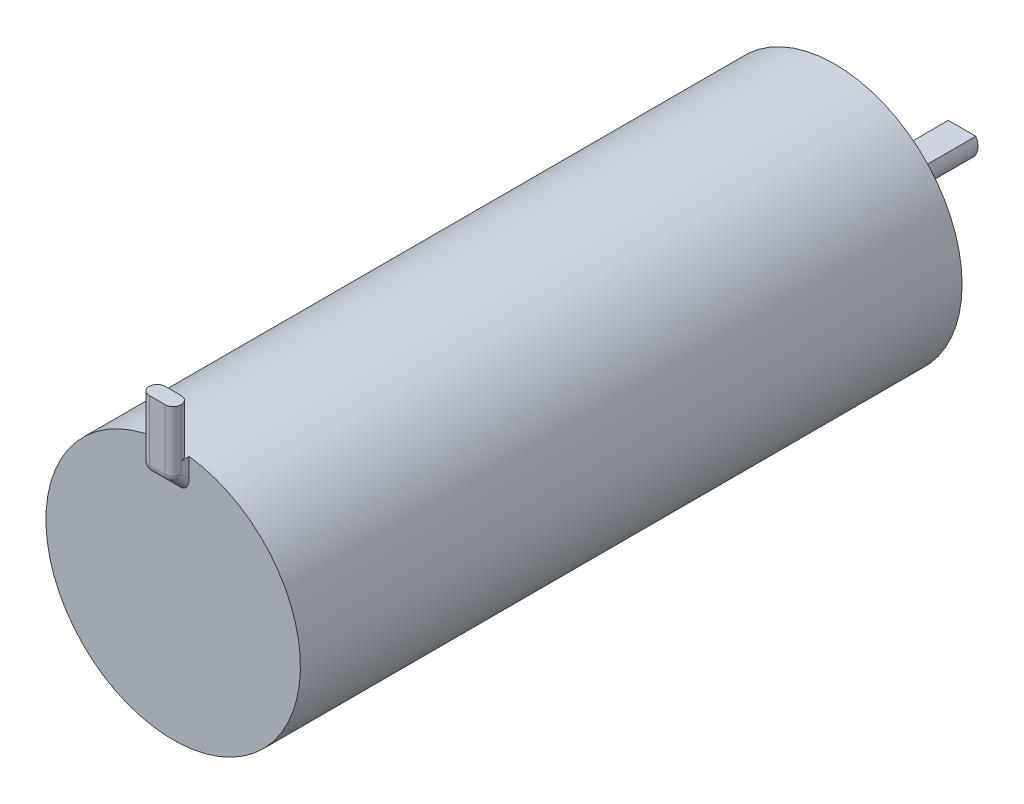
ISO-10303-21;
HEADER;
FILE_DESCRIPTION(('STEP AP214'),'2;1');
FILE_NAME('part.step','',(''),(''),'','','');
FILE_SCHEMA(('AUTOMOTIVE_DESIGN { 1 0 10303 214 1 1 1 1 }'));
ENDSEC;
DATA;
#1=APPLICATION_CONTEXT('core data for automotive mechanical design processes');
#2=APPLICATION_PROTOCOL_DEFINITION('international standard','automotive_design',2000,#1);
#3=PRODUCT_CONTEXT('',#1,'mechanical');
#4=PRODUCT('Part','Part','',(#3));
#5=PRODUCT_RELATED_PRODUCT_CATEGORY('part','',(#4));
#6=PRODUCT_DEFINITION_FORMATION('','',#4);
#7=PRODUCT_DEFINITION_CONTEXT('part definition',#1,'design');
#8=PRODUCT_DEFINITION('design','',#6,#7);
#9=PRODUCT_DEFINITION_SHAPE('','',#8);
#10=(LENGTH_UNIT() NAMED_UNIT(*) SI_UNIT(.MILLI.,.METRE.));
#11=(NAMED_UNIT(*) PLANE_ANGLE_UNIT() SI_UNIT($,.RADIAN.));
#12=(NAMED_UNIT(*) SI_UNIT($,.STERADIAN.) SOLID_ANGLE_UNIT());
#13=UNCERTAINTY_MEASURE_WITH_UNIT(LENGTH_MEASURE(1.E-05),#10,'distance_accuracy_value','');
#14=(GEOMETRIC_REPRESENTATION_CONTEXT(3) GLOBAL_UNCERTAINTY_ASSIGNED_CONTEXT((#13)) GLOBAL_UNIT_ASSIGNED_CONTEXT((#10,
#11,#12)) REPRESENTATION_CONTEXT('',''));
#15=CARTESIAN_POINT('',(0.,0.,0.));
#16=DIRECTION('',(0.,0.,1.));
#17=DIRECTION('',(1.,0.,0.));
#18=AXIS2_PLACEMENT_3D('',#15,#16,#17);
#19=CARTESIAN_POINT('',(0.,0.,0.));
#20=DIRECTION('',(0.,0.,1.));
#21=DIRECTION('',(1.,0.,0.));
#22=AXIS2_PLACEMENT_3D('',#19,#20,#21);
#23=PLANE('',#22);
#24=CARTESIAN_POINT('',(0.,0.,0.));
#25=DIRECTION('',(0.,0.,1.));
#26=DIRECTION('',(1.,0.,0.));
#27=AXIS2_PLACEMENT_3D('',#24,#25,#26);
#28=CIRCLE('',#27,8.);
#29=CARTESIAN_POINT('',(8.,0.,0.));
#30=VERTEX_POINT('',#29);
#31=EDGE_CURVE('E155',#30,#30,#28,.T.);
#32=ORIENTED_EDGE('',*,*,#31,.F.);
#33=EDGE_LOOP('',(#32));
#34=FACE_BOUND('',#33,.T.);
#35=CARTESIAN_POINT('',(0.,0.,0.));
#36=DIRECTION('',(0.,0.,1.));
#37=DIRECTION('',(1.,0.,0.));
#38=AXIS2_PLACEMENT_3D('',#35,#36,#37);
#39=CIRCLE('',#38,1.);
#40=CARTESIAN_POINT('',(1.,0.,0.));
#41=VERTEX_POINT('',#40);
#42=EDGE_CURVE('E137',#41,#41,#39,.F.);
#43=ORIENTED_EDGE('',*,*,#42,.F.);
#44=EDGE_LOOP('',(#43));
#45=FACE_BOUND('',#44,.T.);
#46=ADVANCED_FACE('F36',(#34,#45),#23,.F.);
#47=CARTESIAN_POINT('',(0.,0.,41.6));
#48=DIRECTION('',(0.,0.,-1.));
#49=DIRECTION('',(-1.,0.,0.));
#50=AXIS2_PLACEMENT_3D('',#47,#48,#49);
#51=CYLINDRICAL_SURFACE('',#50,8.);
#52=CARTESIAN_POINT('',(0.,0.,41.6));
#53=DIRECTION('',(0.,0.,1.));
#54=DIRECTION('',(1.,0.,0.));
#55=AXIS2_PLACEMENT_3D('',#52,#53,#54);
#56=CIRCLE('',#55,8.);
#57=CARTESIAN_POINT('',(0.499999999999999,7.98435971133566,41.6));
#58=VERTEX_POINT('',#57);
#59=CARTESIAN_POINT('',(-0.500000000000001,7.98435971133565,41.6));
#60=VERTEX_POINT('',#59);
#61=EDGE_CURVE('E161',#58,#60,#56,.T.);
#62=ORIENTED_EDGE('',*,*,#61,.F.);
#63=CARTESIAN_POINT('',(0.499999999999999,7.98435971133565,41.6));
#64=CARTESIAN_POINT('',(0.528211966881947,7.98259877056829,41.5999765813087));
#65=CARTESIAN_POINT('',(0.556404932265178,7.98067755120621,41.6023862602534));
#66=CARTESIAN_POINT('',(0.611949749492698,7.97660753691758,41.6118872498728));
#67=CARTESIAN_POINT('',(0.63930231043446,7.97445894104762,41.618974493584));
#68=CARTESIAN_POINT('',(0.692425208747163,7.97002292009895,41.6376502605687));
#69=CARTESIAN_POINT('',(0.718194928128985,7.96773544148065,41.6492405291839));
#70=CARTESIAN_POINT('',(0.767415560756234,7.96314530880473,41.676584171914));
#71=CARTESIAN_POINT('',(0.790866765661462,7.96084265669485,41.6923370214751));
#72=CARTESIAN_POINT('',(0.834832752569999,7.95635248198422,41.7275988043841));
#73=CARTESIAN_POINT('',(0.85534232695351,7.95416516779201,41.7471142590313));
#74=CARTESIAN_POINT('',(0.89279517918921,7.95004859020596,41.7893420183228));
#75=CARTESIAN_POINT('',(0.909737820722047,7.94811937287739,41.8120548921635));
#76=CARTESIAN_POINT('',(0.939526239124845,7.94465327490368,41.8599767760672));
#77=CARTESIAN_POINT('',(0.952381335669353,7.94311550337665,41.8851799335932));
#78=CARTESIAN_POINT('',(0.973663616764573,7.9405349226189,41.9374068345447));
#79=CARTESIAN_POINT('',(0.982093785202894,7.93949177988823,41.9644293372114));
#80=CARTESIAN_POINT('',(0.99211273854697,7.93824463092319,42.0096912906091));
#81=CARTESIAN_POINT('',(0.995068443825916,7.93787411954731,42.0276353473731));
#82=CARTESIAN_POINT('',(0.999011872019128,7.93737843656666,42.0637169413209));
#83=CARTESIAN_POINT('',(1.00000226912277,7.93725293158615,42.0818541817863));
#84=CARTESIAN_POINT('',(0.999999999999999,7.93725393319377,42.1));
#85=B_SPLINE_CURVE_WITH_KNOTS('',3,(#63,#64,#65,#66,#67,#68,#69,#70,#71,#72,#73,#74,#75,#76,#77,
#78,#79,#80,#81,#82,#83,#84),.UNSPECIFIED.,.F.,.F.,(4,2,2,2,2,2,2,2,2,2,4),(0.,
0.084684795232754,0.169296057104691,0.253940146489832,0.338573574404131,0.423355028395603,
0.508151594096252,0.592753412270701,0.677298106875425,0.731765628796676,0.786158985952355),.UNSPECIFIED.);
#86=CARTESIAN_POINT('',(0.999999999999999,7.93725393319377,42.1));
#87=VERTEX_POINT('',#86);
#88=EDGE_CURVE('E238',#58,#87,#85,.T.);
#89=ORIENTED_EDGE('',*,*,#88,.T.);
#90=DIRECTION('',(0.,0.,-1.));
#91=VECTOR('',#90,1.);
#92=CARTESIAN_POINT('',(0.999999999999999,7.93725393319377,41.6));
#93=LINE('',#92,#91);
#94=CARTESIAN_POINT('',(0.999999999999999,7.93725393319377,41.6));
#95=VERTEX_POINT('',#94);
#96=EDGE_CURVE('E60',#95,#87,#93,.F.);
#97=ORIENTED_EDGE('',*,*,#96,.F.);
#98=CARTESIAN_POINT('',(-1.,7.93725393319377,41.6));
#99=VERTEX_POINT('',#98);
#100=EDGE_CURVE('E172',#99,#95,#56,.T.);
#101=ORIENTED_EDGE('',*,*,#100,.F.);
#102=DIRECTION('',(0.,0.,-1.));
#103=VECTOR('',#102,1.);
#104=CARTESIAN_POINT('',(-1.,7.93725393319377,42.1));
#105=LINE('',#104,#103);
#106=CARTESIAN_POINT('',(-1.,7.93725393319377,42.1));
#107=VERTEX_POINT('',#106);
#108=EDGE_CURVE('E207',#107,#99,#105,.T.);
#109=ORIENTED_EDGE('',*,*,#108,.F.);
#110=CARTESIAN_POINT('',(-1.,7.93725393319377,42.1));
#111=CARTESIAN_POINT('',(-1.00002451729943,7.93724662536466,42.0720075643183));
#112=CARTESIAN_POINT('',(-0.997650787091199,7.93754984225721,42.0440241790816));
#113=CARTESIAN_POINT('',(-0.98829013972062,7.93872297592914,41.9888815242111));
#114=CARTESIAN_POINT('',(-0.981308150554138,7.93959228732318,41.9617214066045));
#115=CARTESIAN_POINT('',(-0.962910162137948,7.94184389296303,41.908958415712));
#116=CARTESIAN_POINT('',(-0.951492516323902,7.94322637769592,41.8833561247953));
#117=CARTESIAN_POINT('',(-0.924564287598282,7.94640580445675,41.8344359569982));
#118=CARTESIAN_POINT('',(-0.909054052642224,7.94820271124854,41.8111178861425));
#119=CARTESIAN_POINT('',(-0.874304834044239,7.95210014989678,41.7673124311631));
#120=CARTESIAN_POINT('',(-0.855050034319086,7.9542019596663,41.7468377085396));
#121=CARTESIAN_POINT('',(-0.813393883809545,7.95856948002514,41.7093997431199));
#122=CARTESIAN_POINT('',(-0.790991851298305,7.96083522607322,41.6924372630905));
#123=CARTESIAN_POINT('',(-0.74352285129241,7.96540929805311,41.6624035407285));
#124=CARTESIAN_POINT('',(-0.718440057456876,7.96771780187519,41.649357359664));
#125=CARTESIAN_POINT('',(-0.666434962346622,7.97223581109619,41.6276739408522));
#126=CARTESIAN_POINT('',(-0.639513736527306,7.97444537314295,41.6190341500638));
#127=CARTESIAN_POINT('',(-0.593699357532828,7.97796095832678,41.6084958937252));
#128=CARTESIAN_POINT('',(-0.575095875627013,7.97932411674346,41.6053129007842));
#129=CARTESIAN_POINT('',(-0.537665719098085,7.98193402991067,41.601065027193));
#130=CARTESIAN_POINT('',(-0.51883937163709,7.98318093599397,41.5999973551501));
#131=CARTESIAN_POINT('',(-0.499999999999999,7.98435971133566,41.6));
#132=B_SPLINE_CURVE_WITH_KNOTS('',3,(#110,#111,#112,#113,#114,#115,#116,#117,#118,#119,#120,
#121,#122,#123,#124,#125,#126,#127,#128,#129,#130,#131),.UNSPECIFIED.,.F.,.F.,(4,2,2,2,2,2,2,2,
2,2,4),(0.,0.0838618848451519,0.167634234166573,0.25143771046158,0.335234064006103,
0.419392355957126,0.503568905751166,0.588273167919629,0.672928296936279,0.729584662547124,
0.786166214078912),.UNSPECIFIED.);
#133=EDGE_CURVE('E232',#107,#60,#132,.T.);
#134=ORIENTED_EDGE('',*,*,#133,.T.);
#135=EDGE_LOOP('',(#62,#89,#97,#101,#109,#134));
#136=FACE_BOUND('',#135,.T.);
#137=ORIENTED_EDGE('',*,*,#31,.T.);
#138=EDGE_LOOP('',(#137));
#139=FACE_BOUND('',#138,.T.);
#140=ADVANCED_FACE('F243',(#136,#139),#51,.T.);
#141=CARTESIAN_POINT('',(0.,0.,41.6));
#142=DIRECTION('',(0.,0.,1.));
#143=DIRECTION('',(1.,0.,0.));
#144=AXIS2_PLACEMENT_3D('',#141,#142,#143);
#145=PLANE('',#144);
#146=DIRECTION('',(0.,-1.,0.));
#147=VECTOR('',#146,1.);
#148=CARTESIAN_POINT('',(-1.,11.,41.6));
#149=LINE('',#148,#147);
#150=CARTESIAN_POINT('',(-1.,6.70710678118655,41.6));
#151=VERTEX_POINT('',#150);
#152=EDGE_CURVE('E157',#99,#151,#149,.T.);
#153=ORIENTED_EDGE('',*,*,#152,.F.);
#154=ORIENTED_EDGE('',*,*,#100,.T.);
#155=DIRECTION('',(0.,1.,0.));
#156=VECTOR('',#155,1.);
#157=CARTESIAN_POINT('',(0.999999999999999,11.,41.6));
#158=LINE('',#157,#156);
#159=CARTESIAN_POINT('',(0.999999999999999,6.70710678118655,41.6));
#160=VERTEX_POINT('',#159);
#161=EDGE_CURVE('E165',#160,#95,#158,.T.);
#162=ORIENTED_EDGE('',*,*,#161,.F.);
#163=CARTESIAN_POINT('',(0.499999999999999,6.70710678118655,41.6));
#164=DIRECTION('',(0.,0.,1.));
#165=DIRECTION('',(0.,1.,0.));
#166=AXIS2_PLACEMENT_3D('',#163,#164,#165);
#167=ELLIPSE('',#166,0.707106781186545,0.5);
#168=CARTESIAN_POINT('',(0.5,6.,41.6));
#169=VERTEX_POINT('',#168);
#170=EDGE_CURVE('E204',#160,#169,#167,.F.);
#171=ORIENTED_EDGE('',*,*,#170,.T.);
#172=DIRECTION('',(1.,0.,0.));
#173=VECTOR('',#172,1.);
#174=CARTESIAN_POINT('',(-1.,6.,41.6));
#175=LINE('',#174,#173);
#176=CARTESIAN_POINT('',(-0.500000000000001,6.,41.6));
#177=VERTEX_POINT('',#176);
#178=EDGE_CURVE('E162',#177,#169,#175,.T.);
#179=ORIENTED_EDGE('',*,*,#178,.F.);
#180=CARTESIAN_POINT('',(-0.500000000000001,6.70710678118655,41.6));
#181=DIRECTION('',(0.,0.,1.));
#182=DIRECTION('',(0.,-1.,0.));
#183=AXIS2_PLACEMENT_3D('',#180,#181,#182);
#184=ELLIPSE('',#183,0.707106781186545,0.5);
#185=EDGE_CURVE('E206',#177,#151,#184,.F.);
#186=ORIENTED_EDGE('',*,*,#185,.T.);
#187=EDGE_LOOP('',(#153,#154,#162,#171,#179,#186));
#188=FACE_BOUND('',#187,.T.);
#189=ADVANCED_FACE('F294',(#188),#145,.T.);
#190=CARTESIAN_POINT('',(0.,0.,41.6));
#191=DIRECTION('',(0.,0.,1.));
#192=DIRECTION('',(1.,0.,0.));
#193=AXIS2_PLACEMENT_3D('',#190,#191,#192);
#194=PLANE('',#193);
#195=ORIENTED_EDGE('',*,*,#61,.T.);
#196=DIRECTION('',(0.,-1.,0.));
#197=VECTOR('',#196,1.);
#198=CARTESIAN_POINT('',(-0.499999999999999,0.,41.6));
#199=LINE('',#198,#197);
#200=CARTESIAN_POINT('',(-0.500000000000002,11.,41.6));
#201=VERTEX_POINT('',#200);
#202=EDGE_CURVE('E225',#60,#201,#199,.F.);
#203=ORIENTED_EDGE('',*,*,#202,.T.);
#204=DIRECTION('',(-1.,0.,0.));
#205=VECTOR('',#204,1.);
#206=CARTESIAN_POINT('',(-1.,11.,41.6));
#207=LINE('',#206,#205);
#208=CARTESIAN_POINT('',(0.499999999999999,11.,41.6));
#209=VERTEX_POINT('',#208);
#210=EDGE_CURVE('E156',#209,#201,#207,.T.);
#211=ORIENTED_EDGE('',*,*,#210,.F.);
#212=DIRECTION('',(0.,1.,0.));
#213=VECTOR('',#212,1.);
#214=CARTESIAN_POINT('',(0.500000000000001,0.,41.6));
#215=LINE('',#214,#213);
#216=EDGE_CURVE('E223',#209,#58,#215,.F.);
#217=ORIENTED_EDGE('',*,*,#216,.T.);
#218=EDGE_LOOP('',(#195,#203,#211,#217));
#219=FACE_BOUND('',#218,.T.);
#220=ADVANCED_FACE('F300',(#219),#194,.F.);
#221=CARTESIAN_POINT('',(-1.,11.,42.6));
#222=DIRECTION('',(1.,0.,0.));
#223=DIRECTION('',(0.,1.,0.));
#224=AXIS2_PLACEMENT_3D('',#221,#222,#223);
#225=PLANE('',#224);
#226=DIRECTION('',(0.,-1.,0.));
#227=VECTOR('',#226,1.);
#228=CARTESIAN_POINT('',(-1.,11.,42.1));
#229=LINE('',#228,#227);
#230=CARTESIAN_POINT('',(-1.,7.20710678118655,42.1));
#231=VERTEX_POINT('',#230);
#232=EDGE_CURVE('E199',#231,#107,#229,.F.);
#233=ORIENTED_EDGE('',*,*,#232,.T.);
#234=ORIENTED_EDGE('',*,*,#108,.T.);
#235=ORIENTED_EDGE('',*,*,#152,.T.);
#236=DIRECTION('',(0.,0.707106781186545,0.70710678118655));
#237=VECTOR('',#236,1.);
#238=CARTESIAN_POINT('',(-1.,7.35355339059327,42.2464466094067));
#239=LINE('',#238,#237);
#240=EDGE_CURVE('E202',#151,#231,#239,.T.);
#241=ORIENTED_EDGE('',*,*,#240,.T.);
#242=EDGE_LOOP('',(#233,#234,#235,#241));
#243=FACE_BOUND('',#242,.T.);
#244=ADVANCED_FACE('F302',(#243),#225,.F.);
#245=CARTESIAN_POINT('',(0.999999999999999,11.,42.6));
#246=DIRECTION('',(-1.,0.,0.));
#247=DIRECTION('',(0.,-1.,0.));
#248=AXIS2_PLACEMENT_3D('',#245,#246,#247);
#249=PLANE('',#248);
#250=ORIENTED_EDGE('',*,*,#161,.T.);
#251=ORIENTED_EDGE('',*,*,#96,.T.);
#252=DIRECTION('',(0.,1.,0.));
#253=VECTOR('',#252,1.);
#254=CARTESIAN_POINT('',(0.999999999999999,7.,42.1));
#255=LINE('',#254,#253);
#256=CARTESIAN_POINT('',(0.999999999999999,7.20710678118654,42.1));
#257=VERTEX_POINT('',#256);
#258=EDGE_CURVE('E187',#87,#257,#255,.F.);
#259=ORIENTED_EDGE('',*,*,#258,.T.);
#260=DIRECTION('',(0.,-0.707106781186545,-0.70710678118655));
#261=VECTOR('',#260,1.);
#262=CARTESIAN_POINT('',(1.,6.35355339059328,41.2464466094067));
#263=LINE('',#262,#261);
#264=EDGE_CURVE('E191',#257,#160,#263,.T.);
#265=ORIENTED_EDGE('',*,*,#264,.T.);
#266=EDGE_LOOP('',(#250,#251,#259,#265));
#267=FACE_BOUND('',#266,.T.);
#268=ADVANCED_FACE('F305',(#267),#249,.F.);
#269=CARTESIAN_POINT('',(-1.,11.,42.6));
#270=DIRECTION('',(0.,-1.,0.));
#271=DIRECTION('',(1.,0.,0.));
#272=AXIS2_PLACEMENT_3D('',#269,#270,#271);
#273=PLANE('',#272);
#274=ORIENTED_EDGE('',*,*,#210,.T.);
#275=CARTESIAN_POINT('',(-0.500000000000002,11.,42.1));
#276=DIRECTION('',(0.,-1.,0.));
#277=DIRECTION('',(1.,0.,0.));
#278=AXIS2_PLACEMENT_3D('',#275,#276,#277);
#279=CIRCLE('',#278,0.5);
#280=CARTESIAN_POINT('',(-1.,11.,42.1));
#281=VERTEX_POINT('',#280);
#282=EDGE_CURVE('E229',#201,#281,#279,.F.);
#283=ORIENTED_EDGE('',*,*,#282,.T.);
#284=CARTESIAN_POINT('',(-0.500000000000002,11.,42.1));
#285=DIRECTION('',(0.,-1.,0.));
#286=DIRECTION('',(1.,0.,0.));
#287=AXIS2_PLACEMENT_3D('',#284,#285,#286);
#288=CIRCLE('',#287,0.5);
#289=CARTESIAN_POINT('',(-0.500000000000002,11.,42.6));
#290=VERTEX_POINT('',#289);
#291=EDGE_CURVE('E193',#281,#290,#288,.F.);
#292=ORIENTED_EDGE('',*,*,#291,.T.);
#293=DIRECTION('',(-1.,0.,0.));
#294=VECTOR('',#293,1.);
#295=CARTESIAN_POINT('',(-1.,11.,42.6));
#296=LINE('',#295,#294);
#297=CARTESIAN_POINT('',(0.499999999999999,11.,42.6));
#298=VERTEX_POINT('',#297);
#299=EDGE_CURVE('E152',#298,#290,#296,.T.);
#300=ORIENTED_EDGE('',*,*,#299,.F.);
#301=CARTESIAN_POINT('',(0.499999999999999,11.,42.1));
#302=DIRECTION('',(0.,-1.,0.));
#303=DIRECTION('',(1.,0.,0.));
#304=AXIS2_PLACEMENT_3D('',#301,#302,#303);
#305=CIRCLE('',#304,0.5);
#306=CARTESIAN_POINT('',(0.999999999999999,11.,42.1));
#307=VERTEX_POINT('',#306);
#308=EDGE_CURVE('E195',#298,#307,#305,.F.);
#309=ORIENTED_EDGE('',*,*,#308,.T.);
#310=CARTESIAN_POINT('',(0.499999999999999,11.,42.1));
#311=DIRECTION('',(0.,-1.,0.));
#312=DIRECTION('',(1.,0.,0.));
#313=AXIS2_PLACEMENT_3D('',#310,#311,#312);
#314=CIRCLE('',#313,0.5);
#315=EDGE_CURVE('E227',#307,#209,#314,.F.);
#316=ORIENTED_EDGE('',*,*,#315,.T.);
#317=EDGE_LOOP('',(#274,#283,#292,#300,#309,#316));
#318=FACE_BOUND('',#317,.T.);
#319=ADVANCED_FACE('F286',(#318),#273,.F.);
#320=CARTESIAN_POINT('',(0.,0.,42.6));
#321=DIRECTION('',(0.,0.,1.));
#322=DIRECTION('',(1.,0.,0.));
#323=AXIS2_PLACEMENT_3D('',#320,#321,#322);
#324=PLANE('',#323);
#325=DIRECTION('',(1.,0.,0.));
#326=VECTOR('',#325,1.);
#327=CARTESIAN_POINT('',(0.,7.20710678118655,42.6));
#328=LINE('',#327,#326);
#329=CARTESIAN_POINT('',(-0.500000000000001,7.20710678118655,42.6));
#330=VERTEX_POINT('',#329);
#331=CARTESIAN_POINT('',(0.499999999999999,7.20710678118655,42.6));
#332=VERTEX_POINT('',#331);
#333=EDGE_CURVE('E176',#330,#332,#328,.T.);
#334=ORIENTED_EDGE('',*,*,#333,.T.);
#335=DIRECTION('',(0.,1.,0.));
#336=VECTOR('',#335,1.);
#337=CARTESIAN_POINT('',(0.499999999999999,11.,42.6));
#338=LINE('',#337,#336);
#339=EDGE_CURVE('E179',#332,#298,#338,.T.);
#340=ORIENTED_EDGE('',*,*,#339,.T.);
#341=ORIENTED_EDGE('',*,*,#299,.T.);
#342=DIRECTION('',(0.,-1.,0.));
#343=VECTOR('',#342,1.);
#344=CARTESIAN_POINT('',(-0.500000000000001,7.,42.6));
#345=LINE('',#344,#343);
#346=EDGE_CURVE('E160',#290,#330,#345,.T.);
#347=ORIENTED_EDGE('',*,*,#346,.T.);
#348=EDGE_LOOP('',(#334,#340,#341,#347));
#349=FACE_BOUND('',#348,.T.);
#350=ADVANCED_FACE('F281',(#349),#324,.T.);
#351=CARTESIAN_POINT('',(0.,7.,42.6));
#352=DIRECTION('',(0.,-0.70710678118655,0.707106781186545));
#353=DIRECTION('',(-1.,0.,0.));
#354=AXIS2_PLACEMENT_3D('',#351,#352,#353);
#355=PLANE('',#354);
#356=ORIENTED_EDGE('',*,*,#178,.T.);
#357=DIRECTION('',(0.,-0.707106781186545,-0.70710678118655));
#358=VECTOR('',#357,1.);
#359=CARTESIAN_POINT('',(0.499999999999999,7.,42.6));
#360=LINE('',#359,#358);
#361=CARTESIAN_POINT('',(0.499999999999999,6.85355339059327,42.4535533905933));
#362=VERTEX_POINT('',#361);
#363=EDGE_CURVE('E185',#169,#362,#360,.F.);
#364=ORIENTED_EDGE('',*,*,#363,.T.);
#365=DIRECTION('',(1.,0.,0.));
#366=VECTOR('',#365,1.);
#367=CARTESIAN_POINT('',(0.,6.85355339059327,42.4535533905933));
#368=LINE('',#367,#366);
#369=CARTESIAN_POINT('',(-0.500000000000001,6.85355339059327,42.4535533905933));
#370=VERTEX_POINT('',#369);
#371=EDGE_CURVE('E183',#362,#370,#368,.F.);
#372=ORIENTED_EDGE('',*,*,#371,.T.);
#373=DIRECTION('',(0.,0.707106781186545,0.70710678118655));
#374=VECTOR('',#373,1.);
#375=CARTESIAN_POINT('',(-0.500000000000001,6.00000000000001,41.6));
#376=LINE('',#375,#374);
#377=EDGE_CURVE('E181',#370,#177,#376,.F.);
#378=ORIENTED_EDGE('',*,*,#377,.T.);
#379=EDGE_LOOP('',(#356,#364,#372,#378));
#380=FACE_BOUND('',#379,.T.);
#381=ADVANCED_FACE('F257',(#380),#355,.T.);
#382=CARTESIAN_POINT('',(-0.500000000000001,9.35355339059326,44.2464466094067));
#383=DIRECTION('',(0.,-0.707106781186545,-0.70710678118655));
#384=DIRECTION('',(0.,0.70710678118655,-0.707106781186545));
#385=AXIS2_PLACEMENT_3D('',#382,#383,#384);
#386=CYLINDRICAL_SURFACE('',#385,0.5);
#387=ORIENTED_EDGE('',*,*,#185,.F.);
#388=ORIENTED_EDGE('',*,*,#377,.F.);
#389=CARTESIAN_POINT('',(-0.500000000000001,7.20710678118655,42.1));
#390=DIRECTION('',(0.,0.707106781186547,0.707106781186548));
#391=DIRECTION('',(0.,-0.707106781186548,0.707106781186547));
#392=AXIS2_PLACEMENT_3D('',#389,#390,#391);
#393=CIRCLE('',#392,0.5);
#394=EDGE_CURVE('E166',#231,#370,#393,.T.);
#395=ORIENTED_EDGE('',*,*,#394,.F.);
#396=ORIENTED_EDGE('',*,*,#240,.F.);
#397=EDGE_LOOP('',(#387,#388,#395,#396));
#398=FACE_BOUND('',#397,.T.);
#399=ADVANCED_FACE('F253',(#398),#386,.T.);
#400=CARTESIAN_POINT('',(-0.499999999999999,0.,42.1));
#401=DIRECTION('',(0.,1.,0.));
#402=DIRECTION('',(-1.,0.,0.));
#403=AXIS2_PLACEMENT_3D('',#400,#401,#402);
#404=CYLINDRICAL_SURFACE('',#403,0.5);
#405=ORIENTED_EDGE('',*,*,#291,.F.);
#406=EDGE_CURVE('E198',#107,#281,#229,.F.);
#407=ORIENTED_EDGE('',*,*,#406,.F.);
#408=ORIENTED_EDGE('',*,*,#232,.F.);
#409=CARTESIAN_POINT('',(-0.500000000000001,7.20710678118655,42.1));
#410=DIRECTION('',(0.,-1.,0.));
#411=DIRECTION('',(1.,0.,0.));
#412=AXIS2_PLACEMENT_3D('',#409,#410,#411);
#413=CIRCLE('',#412,0.5);
#414=EDGE_CURVE('E217',#330,#231,#413,.T.);
#415=ORIENTED_EDGE('',*,*,#414,.F.);
#416=ORIENTED_EDGE('',*,*,#346,.F.);
#417=EDGE_LOOP('',(#405,#407,#408,#415,#416));
#418=FACE_BOUND('',#417,.T.);
#419=ADVANCED_FACE('F256',(#418),#404,.T.);
#420=CARTESIAN_POINT('',(0.500000000000001,0.,42.1));
#421=DIRECTION('',(0.,-1.,0.));
#422=DIRECTION('',(1.,0.,0.));
#423=AXIS2_PLACEMENT_3D('',#420,#421,#422);
#424=CYLINDRICAL_SURFACE('',#423,0.5);
#425=ORIENTED_EDGE('',*,*,#308,.F.);
#426=ORIENTED_EDGE('',*,*,#339,.F.);
#427=CARTESIAN_POINT('',(0.499999999999999,7.20710678118654,42.1));
#428=DIRECTION('',(0.,-1.,0.));
#429=DIRECTION('',(0.,0.,-1.));
#430=AXIS2_PLACEMENT_3D('',#427,#428,#429);
#431=CIRCLE('',#430,0.5);
#432=EDGE_CURVE('E214',#257,#332,#431,.T.);
#433=ORIENTED_EDGE('',*,*,#432,.F.);
#434=ORIENTED_EDGE('',*,*,#258,.F.);
#435=EDGE_CURVE('E188',#307,#87,#255,.F.);
#436=ORIENTED_EDGE('',*,*,#435,.F.);
#437=EDGE_LOOP('',(#425,#426,#433,#434,#436));
#438=FACE_BOUND('',#437,.T.);
#439=ADVANCED_FACE('F261',(#438),#424,.T.);
#440=CARTESIAN_POINT('',(0.499999999999999,9.35355339059326,44.2464466094067));
#441=DIRECTION('',(0.,0.707106781186545,0.70710678118655));
#442=DIRECTION('',(0.,-0.70710678118655,0.707106781186545));
#443=AXIS2_PLACEMENT_3D('',#440,#441,#442);
#444=CYLINDRICAL_SURFACE('',#443,0.5);
#445=ORIENTED_EDGE('',*,*,#170,.F.);
#446=ORIENTED_EDGE('',*,*,#264,.F.);
#447=CARTESIAN_POINT('',(0.499999999999999,7.20710678118655,42.1));
#448=DIRECTION('',(0.,0.707106781186545,0.70710678118655));
#449=DIRECTION('',(0.,-0.70710678118655,0.707106781186545));
#450=AXIS2_PLACEMENT_3D('',#447,#448,#449);
#451=CIRCLE('',#450,0.5);
#452=EDGE_CURVE('E211',#362,#257,#451,.T.);
#453=ORIENTED_EDGE('',*,*,#452,.F.);
#454=ORIENTED_EDGE('',*,*,#363,.F.);
#455=EDGE_LOOP('',(#445,#446,#453,#454));
#456=FACE_BOUND('',#455,.T.);
#457=ADVANCED_FACE('F265',(#456),#444,.T.);
#458=CARTESIAN_POINT('',(-0.500000000000001,7.20710678118655,42.1));
#459=DIRECTION('',(0.,0.,1.));
#460=DIRECTION('',(1.,0.,0.));
#461=AXIS2_PLACEMENT_3D('',#458,#459,#460);
#462=SPHERICAL_SURFACE('',#461,0.5);
#463=ORIENTED_EDGE('',*,*,#414,.T.);
#464=ORIENTED_EDGE('',*,*,#394,.T.);
#465=CARTESIAN_POINT('',(-0.500000000000001,7.20710678118655,42.1));
#466=DIRECTION('',(-1.,0.,0.));
#467=DIRECTION('',(0.,0.,1.));
#468=AXIS2_PLACEMENT_3D('',#465,#466,#467);
#469=CIRCLE('',#468,0.5);
#470=EDGE_CURVE('E148',#330,#370,#469,.F.);
#471=ORIENTED_EDGE('',*,*,#470,.F.);
#472=EDGE_LOOP('',(#463,#464,#471));
#473=FACE_BOUND('',#472,.T.);
#474=ADVANCED_FACE('F269',(#473),#462,.T.);
#475=CARTESIAN_POINT('',(0.499999999999999,7.20710678118655,42.1));
#476=DIRECTION('',(0.,0.,1.));
#477=DIRECTION('',(1.,0.,0.));
#478=AXIS2_PLACEMENT_3D('',#475,#476,#477);
#479=SPHERICAL_SURFACE('',#478,0.5);
#480=ORIENTED_EDGE('',*,*,#452,.T.);
#481=ORIENTED_EDGE('',*,*,#432,.T.);
#482=CARTESIAN_POINT('',(0.499999999999999,7.20710678118655,42.1));
#483=DIRECTION('',(1.,0.,0.));
#484=DIRECTION('',(0.,1.,0.));
#485=AXIS2_PLACEMENT_3D('',#482,#483,#484);
#486=CIRCLE('',#485,0.5);
#487=EDGE_CURVE('E146',#362,#332,#486,.F.);
#488=ORIENTED_EDGE('',*,*,#487,.F.);
#489=EDGE_LOOP('',(#480,#481,#488));
#490=FACE_BOUND('',#489,.T.);
#491=ADVANCED_FACE('F273',(#490),#479,.T.);
#492=CARTESIAN_POINT('',(0.,7.20710678118655,42.1));
#493=DIRECTION('',(1.,0.,0.));
#494=DIRECTION('',(0.,0.,-1.));
#495=AXIS2_PLACEMENT_3D('',#492,#493,#494);
#496=CYLINDRICAL_SURFACE('',#495,0.5);
#497=ORIENTED_EDGE('',*,*,#470,.T.);
#498=ORIENTED_EDGE('',*,*,#371,.F.);
#499=ORIENTED_EDGE('',*,*,#487,.T.);
#500=ORIENTED_EDGE('',*,*,#333,.F.);
#501=EDGE_LOOP('',(#497,#498,#499,#500));
#502=FACE_BOUND('',#501,.T.);
#503=ADVANCED_FACE('F251',(#502),#496,.T.);
#504=CARTESIAN_POINT('',(-0.500000000000002,11.,42.1));
#505=DIRECTION('',(0.,-1.,0.));
#506=DIRECTION('',(1.,0.,0.));
#507=AXIS2_PLACEMENT_3D('',#504,#505,#506);
#508=CYLINDRICAL_SURFACE('',#507,0.5);
#509=ORIENTED_EDGE('',*,*,#282,.F.);
#510=ORIENTED_EDGE('',*,*,#202,.F.);
#511=ORIENTED_EDGE('',*,*,#133,.F.);
#512=ORIENTED_EDGE('',*,*,#406,.T.);
#513=EDGE_LOOP('',(#509,#510,#511,#512));
#514=FACE_BOUND('',#513,.T.);
#515=ADVANCED_FACE('F247',(#514),#508,.T.);
#516=CARTESIAN_POINT('',(0.499999999999999,11.,42.1));
#517=DIRECTION('',(0.,1.,0.));
#518=DIRECTION('',(-1.,0.,0.));
#519=AXIS2_PLACEMENT_3D('',#516,#517,#518);
#520=CYLINDRICAL_SURFACE('',#519,0.5);
#521=ORIENTED_EDGE('',*,*,#88,.F.);
#522=ORIENTED_EDGE('',*,*,#216,.F.);
#523=ORIENTED_EDGE('',*,*,#315,.F.);
#524=ORIENTED_EDGE('',*,*,#435,.T.);
#525=EDGE_LOOP('',(#521,#522,#523,#524));
#526=FACE_BOUND('',#525,.T.);
#527=ADVANCED_FACE('F38',(#526),#520,.T.);
#528=CARTESIAN_POINT('',(0.,0.,-8.));
#529=DIRECTION('',(0.,0.,1.));
#530=DIRECTION('',(1.,0.,0.));
#531=AXIS2_PLACEMENT_3D('',#528,#529,#530);
#532=CYLINDRICAL_SURFACE('',#531,1.);
#533=CARTESIAN_POINT('',(0.,0.,-8.));
#534=DIRECTION('',(0.,0.,-1.));
#535=DIRECTION('',(-1.,0.,0.));
#536=AXIS2_PLACEMENT_3D('',#533,#534,#535);
#537=CIRCLE('',#536,1.);
#538=CARTESIAN_POINT('',(0.866025403784439,0.5,-8.));
#539=VERTEX_POINT('',#538);
#540=CARTESIAN_POINT('',(-0.866025403784438,0.5,-8.));
#541=VERTEX_POINT('',#540);
#542=EDGE_CURVE('E142',#539,#541,#537,.T.);
#543=ORIENTED_EDGE('',*,*,#542,.F.);
#544=DIRECTION('',(0.,0.,1.));
#545=VECTOR('',#544,1.);
#546=CARTESIAN_POINT('',(0.866025403784439,0.5,-8.));
#547=LINE('',#546,#545);
#548=CARTESIAN_POINT('',(0.866025403784439,0.5,-4.));
#549=VERTEX_POINT('',#548);
#550=EDGE_CURVE('E52',#539,#549,#547,.T.);
#551=ORIENTED_EDGE('',*,*,#550,.T.);
#552=CARTESIAN_POINT('',(0.,0.,-4.));
#553=DIRECTION('',(0.,0.,-1.));
#554=DIRECTION('',(-1.,0.,0.));
#555=AXIS2_PLACEMENT_3D('',#552,#553,#554);
#556=CIRCLE('',#555,1.);
#557=CARTESIAN_POINT('',(-0.866025403784439,0.5,-4.));
#558=VERTEX_POINT('',#557);
#559=EDGE_CURVE('E11',#558,#549,#556,.T.);
#560=ORIENTED_EDGE('',*,*,#559,.F.);
#561=DIRECTION('',(0.,0.,1.));
#562=VECTOR('',#561,1.);
#563=CARTESIAN_POINT('',(-0.866025403784439,0.5,-8.));
#564=LINE('',#563,#562);
#565=EDGE_CURVE('E132',#558,#541,#564,.F.);
#566=ORIENTED_EDGE('',*,*,#565,.T.);
#567=EDGE_LOOP('',(#543,#551,#560,#566));
#568=FACE_BOUND('',#567,.T.);
#569=ORIENTED_EDGE('',*,*,#42,.T.);
#570=EDGE_LOOP('',(#569));
#571=FACE_BOUND('',#570,.T.);
#572=ADVANCED_FACE('F140',(#568,#571),#532,.T.);
#573=CARTESIAN_POINT('',(0.,0.,-8.));
#574=DIRECTION('',(0.,0.,-1.));
#575=DIRECTION('',(-1.,0.,0.));
#576=AXIS2_PLACEMENT_3D('',#573,#574,#575);
#577=PLANE('',#576);
#578=DIRECTION('',(-1.,0.,0.));
#579=VECTOR('',#578,1.);
#580=CARTESIAN_POINT('',(0.,0.5,-8.));
#581=LINE('',#580,#579);
#582=EDGE_CURVE('E45',#539,#541,#581,.T.);
#583=ORIENTED_EDGE('',*,*,#582,.F.);
#584=ORIENTED_EDGE('',*,*,#542,.T.);
#585=EDGE_LOOP('',(#583,#584));
#586=FACE_BOUND('',#585,.T.);
#587=ADVANCED_FACE('F145',(#586),#577,.T.);
#588=CARTESIAN_POINT('',(0.,0.,-4.));
#589=DIRECTION('',(0.,0.,-1.));
#590=DIRECTION('',(-1.,0.,0.));
#591=AXIS2_PLACEMENT_3D('',#588,#589,#590);
#592=PLANE('',#591);
#593=ORIENTED_EDGE('',*,*,#559,.T.);
#594=DIRECTION('',(-1.,0.,0.));
#595=VECTOR('',#594,1.);
#596=CARTESIAN_POINT('',(1.28716119373239,0.5,-4.));
#597=LINE('',#596,#595);
#598=EDGE_CURVE('E143',#549,#558,#597,.T.);
#599=ORIENTED_EDGE('',*,*,#598,.T.);
#600=EDGE_LOOP('',(#593,#599));
#601=FACE_BOUND('',#600,.T.);
#602=ADVANCED_FACE('F320',(#601),#592,.T.);
#603=CARTESIAN_POINT('',(1.28716119373239,0.5,-4.));
#604=DIRECTION('',(0.,-1.,0.));
#605=DIRECTION('',(0.,0.,-1.));
#606=AXIS2_PLACEMENT_3D('',#603,#604,#605);
#607=PLANE('',#606);
#608=ORIENTED_EDGE('',*,*,#582,.T.);
#609=ORIENTED_EDGE('',*,*,#565,.F.);
#610=ORIENTED_EDGE('',*,*,#598,.F.);
#611=ORIENTED_EDGE('',*,*,#550,.F.);
#612=EDGE_LOOP('',(#608,#609,#610,#611));
#613=FACE_BOUND('',#612,.T.);
#614=ADVANCED_FACE('F131',(#613),#607,.F.);
#615=CLOSED_SHELL('',(#46,#140,#189,#220,#244,#268,#319,#350,#381,#399,#419,#439,#457,#474,#491,
#503,#515,#527,#572,#587,#602,#614));
#616=MANIFOLD_SOLID_BREP('B2',#615);
#617=ADVANCED_BREP_SHAPE_REPRESENTATION('',(#18,#616),#14);
#618=SHAPE_DEFINITION_REPRESENTATION(#9,#617);
ENDSEC;
END-ISO-10303-21;
